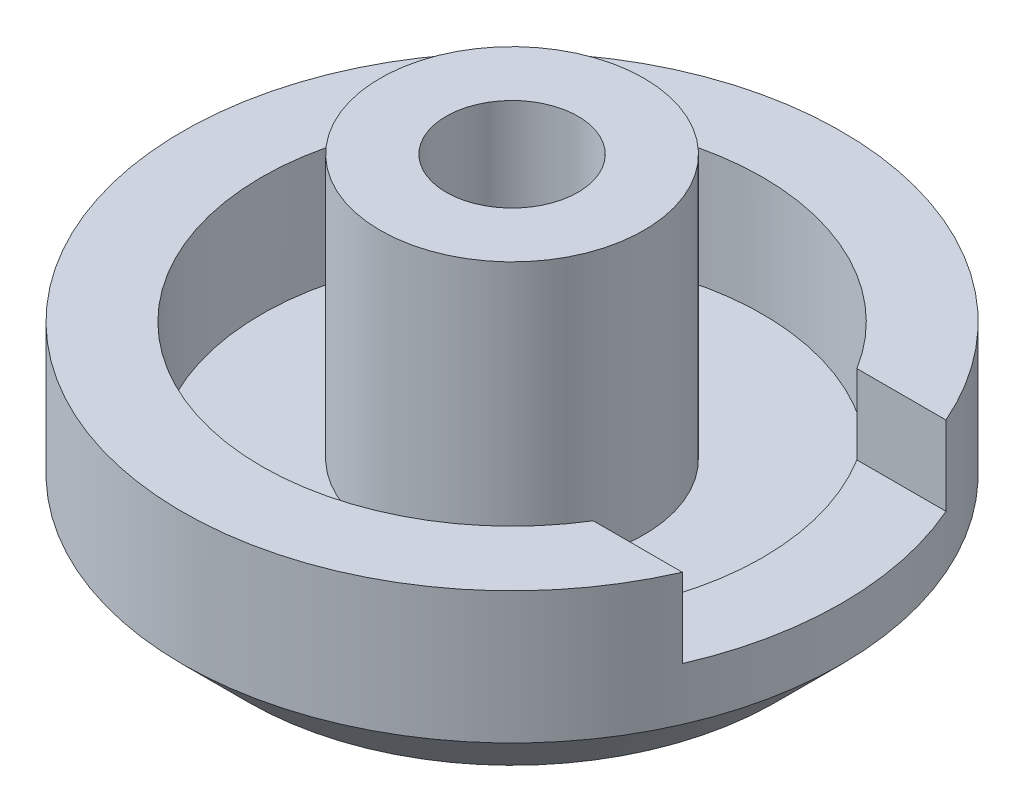
ISO-10303-21;
HEADER;
FILE_DESCRIPTION(('STEP AP214'),'2;1');
FILE_NAME('part.step','',(''),(''),'','','');
FILE_SCHEMA(('AUTOMOTIVE_DESIGN { 1 0 10303 214 1 1 1 1 }'));
ENDSEC;
DATA;
#1=APPLICATION_CONTEXT('core data for automotive mechanical design processes');
#2=APPLICATION_PROTOCOL_DEFINITION('international standard','automotive_design',2000,#1);
#3=PRODUCT_CONTEXT('',#1,'mechanical');
#4=PRODUCT('Part','Part','',(#3));
#5=PRODUCT_RELATED_PRODUCT_CATEGORY('part','',(#4));
#6=PRODUCT_DEFINITION_FORMATION('','',#4);
#7=PRODUCT_DEFINITION_CONTEXT('part definition',#1,'design');
#8=PRODUCT_DEFINITION('design','',#6,#7);
#9=PRODUCT_DEFINITION_SHAPE('','',#8);
#10=(LENGTH_UNIT() NAMED_UNIT(*) SI_UNIT(.MILLI.,.METRE.));
#11=(NAMED_UNIT(*) PLANE_ANGLE_UNIT() SI_UNIT($,.RADIAN.));
#12=(NAMED_UNIT(*) SI_UNIT($,.STERADIAN.) SOLID_ANGLE_UNIT());
#13=UNCERTAINTY_MEASURE_WITH_UNIT(LENGTH_MEASURE(1.E-05),#10,'distance_accuracy_value','');
#14=(GEOMETRIC_REPRESENTATION_CONTEXT(3) GLOBAL_UNCERTAINTY_ASSIGNED_CONTEXT((#13)) GLOBAL_UNIT_ASSIGNED_CONTEXT((#10,
#11,#12)) REPRESENTATION_CONTEXT('',''));
#15=CARTESIAN_POINT('',(0.,0.,0.));
#16=DIRECTION('',(0.,0.,1.));
#17=DIRECTION('',(1.,0.,0.));
#18=AXIS2_PLACEMENT_3D('',#15,#16,#17);
#19=CARTESIAN_POINT('',(0.,3.,0.));
#20=DIRECTION('',(0.,-1.,0.));
#21=DIRECTION('',(0.,0.,-1.));
#22=AXIS2_PLACEMENT_3D('',#19,#20,#21);
#23=CYLINDRICAL_SURFACE('',#22,5.);
#24=CARTESIAN_POINT('',(0.,1.,0.));
#25=DIRECTION('',(0.,1.,0.));
#26=DIRECTION('',(0.,0.,1.));
#27=AXIS2_PLACEMENT_3D('',#24,#25,#26);
#28=CIRCLE('',#27,5.);
#29=CARTESIAN_POINT('',(0.,1.,5.));
#30=VERTEX_POINT('',#29);
#31=EDGE_CURVE('E54',#30,#30,#28,.T.);
#32=ORIENTED_EDGE('',*,*,#31,.T.);
#33=EDGE_LOOP('',(#32));
#34=FACE_BOUND('',#33,.T.);
#35=CARTESIAN_POINT('',(0.,1.8,0.));
#36=DIRECTION('',(0.,-1.,0.));
#37=DIRECTION('',(0.,0.,-1.));
#38=AXIS2_PLACEMENT_3D('',#35,#36,#37);
#39=CIRCLE('',#38,5.);
#40=CARTESIAN_POINT('',(4.58257569495584,1.8,-2.));
#41=VERTEX_POINT('',#40);
#42=CARTESIAN_POINT('',(4.58257569495584,1.8,2.));
#43=VERTEX_POINT('',#42);
#44=EDGE_CURVE('E66',#41,#43,#39,.T.);
#45=ORIENTED_EDGE('',*,*,#44,.T.);
#46=DIRECTION('',(0.,-1.,0.));
#47=VECTOR('',#46,1.);
#48=CARTESIAN_POINT('',(4.58257569495584,3.,2.));
#49=LINE('',#48,#47);
#50=CARTESIAN_POINT('',(4.58257569495584,3.,2.));
#51=VERTEX_POINT('',#50);
#52=EDGE_CURVE('E196',#43,#51,#49,.F.);
#53=ORIENTED_EDGE('',*,*,#52,.T.);
#54=CARTESIAN_POINT('',(0.,3.,0.));
#55=DIRECTION('',(0.,1.,0.));
#56=DIRECTION('',(0.,0.,1.));
#57=AXIS2_PLACEMENT_3D('',#54,#55,#56);
#58=CIRCLE('',#57,5.);
#59=CARTESIAN_POINT('',(4.58257569495584,3.,-2.));
#60=VERTEX_POINT('',#59);
#61=EDGE_CURVE('E105',#60,#51,#58,.T.);
#62=ORIENTED_EDGE('',*,*,#61,.F.);
#63=DIRECTION('',(0.,-1.,0.));
#64=VECTOR('',#63,1.);
#65=CARTESIAN_POINT('',(4.58257569495584,3.,-2.));
#66=LINE('',#65,#64);
#67=EDGE_CURVE('E182',#60,#41,#66,.T.);
#68=ORIENTED_EDGE('',*,*,#67,.T.);
#69=EDGE_LOOP('',(#45,#53,#62,#68));
#70=FACE_BOUND('',#69,.T.);
#71=ADVANCED_FACE('F44',(#34,#70),#23,.T.);
#72=CARTESIAN_POINT('',(0.,3.,0.));
#73=DIRECTION('',(0.,1.,0.));
#74=DIRECTION('',(0.,0.,1.));
#75=AXIS2_PLACEMENT_3D('',#72,#73,#74);
#76=PLANE('',#75);
#77=DIRECTION('',(1.,0.,0.));
#78=VECTOR('',#77,1.);
#79=CARTESIAN_POINT('',(2.,3.,2.));
#80=LINE('',#79,#78);
#81=CARTESIAN_POINT('',(3.2310988842807,3.,2.));
#82=VERTEX_POINT('',#81);
#83=EDGE_CURVE('E89',#82,#51,#80,.T.);
#84=ORIENTED_EDGE('',*,*,#83,.F.);
#85=CARTESIAN_POINT('',(0.,3.,0.));
#86=DIRECTION('',(0.,1.,0.));
#87=DIRECTION('',(0.,0.,1.));
#88=AXIS2_PLACEMENT_3D('',#85,#86,#87);
#89=CIRCLE('',#88,3.8);
#90=CARTESIAN_POINT('',(3.2310988842807,3.,-2.));
#91=VERTEX_POINT('',#90);
#92=EDGE_CURVE('E103',#91,#82,#89,.T.);
#93=ORIENTED_EDGE('',*,*,#92,.F.);
#94=DIRECTION('',(-1.,0.,0.));
#95=VECTOR('',#94,1.);
#96=CARTESIAN_POINT('',(2.,3.,-2.));
#97=LINE('',#96,#95);
#98=EDGE_CURVE('E107',#60,#91,#97,.T.);
#99=ORIENTED_EDGE('',*,*,#98,.F.);
#100=ORIENTED_EDGE('',*,*,#61,.T.);
#101=EDGE_LOOP('',(#84,#93,#99,#100));
#102=FACE_BOUND('',#101,.T.);
#103=ADVANCED_FACE('F101',(#102),#76,.T.);
#104=CARTESIAN_POINT('',(0.,0.,0.));
#105=DIRECTION('',(0.,1.,0.));
#106=DIRECTION('',(0.,0.,1.));
#107=AXIS2_PLACEMENT_3D('',#104,#105,#106);
#108=PLANE('',#107);
#109=CARTESIAN_POINT('',(0.,0.,0.));
#110=DIRECTION('',(0.,1.,0.));
#111=DIRECTION('',(0.,0.,1.));
#112=AXIS2_PLACEMENT_3D('',#109,#110,#111);
#113=CIRCLE('',#112,3.99999999999999);
#114=CARTESIAN_POINT('',(0.,0.,3.99999999999999));
#115=VERTEX_POINT('',#114);
#116=EDGE_CURVE('E11',#115,#115,#113,.F.);
#117=ORIENTED_EDGE('',*,*,#116,.T.);
#118=EDGE_LOOP('',(#117));
#119=FACE_BOUND('',#118,.T.);
#120=ADVANCED_FACE('F147',(#119),#108,.F.);
#121=CARTESIAN_POINT('',(0.,1.2,0.));
#122=DIRECTION('',(0.,1.,0.));
#123=DIRECTION('',(0.,0.,1.));
#124=AXIS2_PLACEMENT_3D('',#121,#122,#123);
#125=CYLINDRICAL_SURFACE('',#124,3.8);
#126=ORIENTED_EDGE('',*,*,#92,.T.);
#127=DIRECTION('',(0.,1.,0.));
#128=VECTOR('',#127,1.);
#129=CARTESIAN_POINT('',(3.2310988842807,1.2,2.));
#130=LINE('',#129,#128);
#131=CARTESIAN_POINT('',(3.2310988842807,1.8,2.));
#132=VERTEX_POINT('',#131);
#133=EDGE_CURVE('E86',#82,#132,#130,.F.);
#134=ORIENTED_EDGE('',*,*,#133,.T.);
#135=CARTESIAN_POINT('',(0.,1.8,0.));
#136=DIRECTION('',(0.,-1.,0.));
#137=DIRECTION('',(0.,0.,-1.));
#138=AXIS2_PLACEMENT_3D('',#135,#136,#137);
#139=CIRCLE('',#138,3.8);
#140=CARTESIAN_POINT('',(3.2310988842807,1.8,-2.));
#141=VERTEX_POINT('',#140);
#142=EDGE_CURVE('E189',#132,#141,#139,.F.);
#143=ORIENTED_EDGE('',*,*,#142,.T.);
#144=DIRECTION('',(0.,1.,0.));
#145=VECTOR('',#144,1.);
#146=CARTESIAN_POINT('',(3.2310988842807,1.2,-2.));
#147=LINE('',#146,#145);
#148=EDGE_CURVE('E96',#141,#91,#147,.T.);
#149=ORIENTED_EDGE('',*,*,#148,.T.);
#150=EDGE_LOOP('',(#126,#134,#143,#149));
#151=FACE_BOUND('',#150,.T.);
#152=CARTESIAN_POINT('',(0.,1.2,0.));
#153=DIRECTION('',(0.,1.,0.));
#154=DIRECTION('',(0.,0.,1.));
#155=AXIS2_PLACEMENT_3D('',#152,#153,#154);
#156=CIRCLE('',#155,3.8);
#157=CARTESIAN_POINT('',(0.,1.2,3.8));
#158=VERTEX_POINT('',#157);
#159=EDGE_CURVE('E113',#158,#158,#156,.T.);
#160=ORIENTED_EDGE('',*,*,#159,.F.);
#161=EDGE_LOOP('',(#160));
#162=FACE_BOUND('',#161,.T.);
#163=ADVANCED_FACE('F110',(#151,#162),#125,.F.);
#164=CARTESIAN_POINT('',(0.,1.2,0.));
#165=DIRECTION('',(0.,1.,0.));
#166=DIRECTION('',(0.,0.,1.));
#167=AXIS2_PLACEMENT_3D('',#164,#165,#166);
#168=PLANE('',#167);
#169=CARTESIAN_POINT('',(0.,1.2,0.));
#170=DIRECTION('',(0.,1.,0.));
#171=DIRECTION('',(0.,0.,1.));
#172=AXIS2_PLACEMENT_3D('',#169,#170,#171);
#173=CIRCLE('',#172,2.);
#174=CARTESIAN_POINT('',(0.,1.2,2.));
#175=VERTEX_POINT('',#174);
#176=EDGE_CURVE('E121',#175,#175,#173,.T.);
#177=ORIENTED_EDGE('',*,*,#176,.F.);
#178=EDGE_LOOP('',(#177));
#179=FACE_BOUND('',#178,.T.);
#180=ORIENTED_EDGE('',*,*,#159,.T.);
#181=EDGE_LOOP('',(#180));
#182=FACE_BOUND('',#181,.T.);
#183=ADVANCED_FACE('F155',(#179,#182),#168,.T.);
#184=CARTESIAN_POINT('',(0.,5.2,0.));
#185=DIRECTION('',(0.,-1.,0.));
#186=DIRECTION('',(0.,0.,-1.));
#187=AXIS2_PLACEMENT_3D('',#184,#185,#186);
#188=CYLINDRICAL_SURFACE('',#187,2.);
#189=CARTESIAN_POINT('',(0.,5.2,0.));
#190=DIRECTION('',(0.,1.,0.));
#191=DIRECTION('',(0.,0.,1.));
#192=AXIS2_PLACEMENT_3D('',#189,#190,#191);
#193=CIRCLE('',#192,2.);
#194=CARTESIAN_POINT('',(0.,5.2,2.));
#195=VERTEX_POINT('',#194);
#196=EDGE_CURVE('E114',#195,#195,#193,.T.);
#197=ORIENTED_EDGE('',*,*,#196,.F.);
#198=EDGE_LOOP('',(#197));
#199=FACE_BOUND('',#198,.T.);
#200=ORIENTED_EDGE('',*,*,#176,.T.);
#201=EDGE_LOOP('',(#200));
#202=FACE_BOUND('',#201,.T.);
#203=ADVANCED_FACE('F158',(#199,#202),#188,.T.);
#204=CARTESIAN_POINT('',(0.,5.2,0.));
#205=DIRECTION('',(0.,1.,0.));
#206=DIRECTION('',(0.,0.,1.));
#207=AXIS2_PLACEMENT_3D('',#204,#205,#206);
#208=PLANE('',#207);
#209=CARTESIAN_POINT('',(0.,5.2,0.));
#210=DIRECTION('',(0.,1.,0.));
#211=DIRECTION('',(0.,0.,1.));
#212=AXIS2_PLACEMENT_3D('',#209,#210,#211);
#213=CIRCLE('',#212,1.);
#214=CARTESIAN_POINT('',(0.,5.2,1.));
#215=VERTEX_POINT('',#214);
#216=EDGE_CURVE('E199',#215,#215,#213,.T.);
#217=ORIENTED_EDGE('',*,*,#216,.F.);
#218=EDGE_LOOP('',(#217));
#219=FACE_BOUND('',#218,.T.);
#220=ORIENTED_EDGE('',*,*,#196,.T.);
#221=EDGE_LOOP('',(#220));
#222=FACE_BOUND('',#221,.T.);
#223=ADVANCED_FACE('F162',(#219,#222),#208,.T.);
#224=CARTESIAN_POINT('',(0.,1.2,0.));
#225=DIRECTION('',(0.,1.,0.));
#226=DIRECTION('',(0.,0.,1.));
#227=AXIS2_PLACEMENT_3D('',#224,#225,#226);
#228=CYLINDRICAL_SURFACE('',#227,1.);
#229=CARTESIAN_POINT('',(0.,1.2,0.));
#230=DIRECTION('',(0.,1.,0.));
#231=DIRECTION('',(0.,0.,1.));
#232=AXIS2_PLACEMENT_3D('',#229,#230,#231);
#233=CIRCLE('',#232,1.);
#234=CARTESIAN_POINT('',(0.,1.2,1.));
#235=VERTEX_POINT('',#234);
#236=EDGE_CURVE('E200',#235,#235,#233,.T.);
#237=ORIENTED_EDGE('',*,*,#236,.F.);
#238=EDGE_LOOP('',(#237));
#239=FACE_BOUND('',#238,.T.);
#240=ORIENTED_EDGE('',*,*,#216,.T.);
#241=EDGE_LOOP('',(#240));
#242=FACE_BOUND('',#241,.T.);
#243=ADVANCED_FACE('F166',(#239,#242),#228,.F.);
#244=CARTESIAN_POINT('',(0.,1.2,0.));
#245=DIRECTION('',(0.,1.,0.));
#246=DIRECTION('',(0.,0.,1.));
#247=AXIS2_PLACEMENT_3D('',#244,#245,#246);
#248=PLANE('',#247);
#249=ORIENTED_EDGE('',*,*,#236,.T.);
#250=EDGE_LOOP('',(#249));
#251=FACE_BOUND('',#250,.T.);
#252=ADVANCED_FACE('F170',(#251),#248,.T.);
#253=CARTESIAN_POINT('',(2.,1.8,2.));
#254=DIRECTION('',(0.,0.,1.));
#255=DIRECTION('',(1.,0.,0.));
#256=AXIS2_PLACEMENT_3D('',#253,#254,#255);
#257=PLANE('',#256);
#258=DIRECTION('',(1.,0.,0.));
#259=VECTOR('',#258,1.);
#260=CARTESIAN_POINT('',(2.,1.8,2.));
#261=LINE('',#260,#259);
#262=EDGE_CURVE('E91',#132,#43,#261,.T.);
#263=ORIENTED_EDGE('',*,*,#262,.F.);
#264=ORIENTED_EDGE('',*,*,#133,.F.);
#265=ORIENTED_EDGE('',*,*,#83,.T.);
#266=ORIENTED_EDGE('',*,*,#52,.F.);
#267=EDGE_LOOP('',(#263,#264,#265,#266));
#268=FACE_BOUND('',#267,.T.);
#269=ADVANCED_FACE('F88',(#268),#257,.F.);
#270=CARTESIAN_POINT('',(2.,1.8,-2.));
#271=DIRECTION('',(0.,0.,-1.));
#272=DIRECTION('',(-1.,0.,0.));
#273=AXIS2_PLACEMENT_3D('',#270,#271,#272);
#274=PLANE('',#273);
#275=ORIENTED_EDGE('',*,*,#98,.T.);
#276=ORIENTED_EDGE('',*,*,#148,.F.);
#277=DIRECTION('',(-1.,0.,0.));
#278=VECTOR('',#277,1.);
#279=CARTESIAN_POINT('',(2.,1.8,-2.));
#280=LINE('',#279,#278);
#281=EDGE_CURVE('E61',#41,#141,#280,.T.);
#282=ORIENTED_EDGE('',*,*,#281,.F.);
#283=ORIENTED_EDGE('',*,*,#67,.F.);
#284=EDGE_LOOP('',(#275,#276,#282,#283));
#285=FACE_BOUND('',#284,.T.);
#286=ADVANCED_FACE('F140',(#285),#274,.F.);
#287=CARTESIAN_POINT('',(0.,1.8,0.));
#288=DIRECTION('',(0.,-1.,0.));
#289=DIRECTION('',(0.,0.,-1.));
#290=AXIS2_PLACEMENT_3D('',#287,#288,#289);
#291=PLANE('',#290);
#292=ORIENTED_EDGE('',*,*,#281,.T.);
#293=ORIENTED_EDGE('',*,*,#142,.F.);
#294=ORIENTED_EDGE('',*,*,#262,.T.);
#295=ORIENTED_EDGE('',*,*,#44,.F.);
#296=EDGE_LOOP('',(#292,#293,#294,#295));
#297=FACE_BOUND('',#296,.T.);
#298=ADVANCED_FACE('F135',(#297),#291,.F.);
#299=CARTESIAN_POINT('',(0.,1.,0.));
#300=DIRECTION('',(0.,1.,0.));
#301=DIRECTION('',(0.,0.,1.));
#302=AXIS2_PLACEMENT_3D('',#299,#300,#301);
#303=CONICAL_SURFACE('',#302,5.,0.78539816339745);
#304=ORIENTED_EDGE('',*,*,#116,.F.);
#305=EDGE_LOOP('',(#304));
#306=FACE_BOUND('',#305,.T.);
#307=ORIENTED_EDGE('',*,*,#31,.F.);
#308=EDGE_LOOP('',(#307));
#309=FACE_BOUND('',#308,.T.);
#310=ADVANCED_FACE('F47',(#306,#309),#303,.T.);
#311=CLOSED_SHELL('',(#71,#103,#120,#163,#183,#203,#223,#243,#252,#269,#286,#298,#310));
#312=MANIFOLD_SOLID_BREP('B2',#311);
#313=ADVANCED_BREP_SHAPE_REPRESENTATION('',(#18,#312),#14);
#314=SHAPE_DEFINITION_REPRESENTATION(#9,#313);
ENDSEC;
END-ISO-10303-21;
